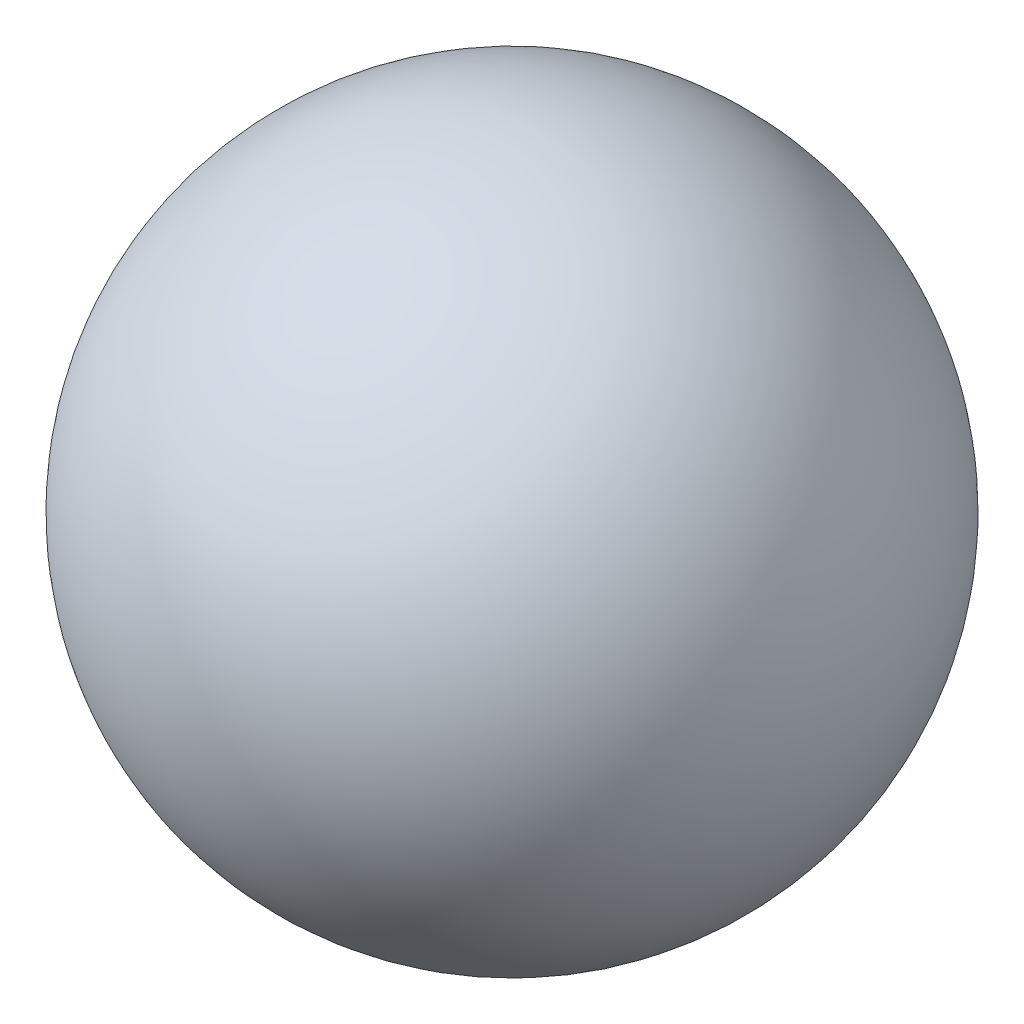
ISO-10303-21;
HEADER;
FILE_DESCRIPTION(('STEP AP214'),'2;1');
FILE_NAME('part.step','',(''),(''),'','','');
FILE_SCHEMA(('AUTOMOTIVE_DESIGN { 1 0 10303 214 1 1 1 1 }'));
ENDSEC;
DATA;
#1=APPLICATION_CONTEXT('core data for automotive mechanical design processes');
#2=APPLICATION_PROTOCOL_DEFINITION('international standard','automotive_design',2000,#1);
#3=PRODUCT_CONTEXT('',#1,'mechanical');
#4=PRODUCT('Part','Part','',(#3));
#5=PRODUCT_RELATED_PRODUCT_CATEGORY('part','',(#4));
#6=PRODUCT_DEFINITION_FORMATION('','',#4);
#7=PRODUCT_DEFINITION_CONTEXT('part definition',#1,'design');
#8=PRODUCT_DEFINITION('design','',#6,#7);
#9=PRODUCT_DEFINITION_SHAPE('','',#8);
#10=(LENGTH_UNIT() NAMED_UNIT(*) SI_UNIT(.MILLI.,.METRE.));
#11=(NAMED_UNIT(*) PLANE_ANGLE_UNIT() SI_UNIT($,.RADIAN.));
#12=(NAMED_UNIT(*) SI_UNIT($,.STERADIAN.) SOLID_ANGLE_UNIT());
#13=UNCERTAINTY_MEASURE_WITH_UNIT(LENGTH_MEASURE(1.E-05),#10,'distance_accuracy_value','');
#14=(GEOMETRIC_REPRESENTATION_CONTEXT(3) GLOBAL_UNCERTAINTY_ASSIGNED_CONTEXT((#13)) GLOBAL_UNIT_ASSIGNED_CONTEXT((#10,
#11,#12)) REPRESENTATION_CONTEXT('',''));
#15=CARTESIAN_POINT('',(0.,0.,0.));
#16=DIRECTION('',(0.,0.,1.));
#17=DIRECTION('',(1.,0.,0.));
#18=AXIS2_PLACEMENT_3D('',#15,#16,#17);
#19=CARTESIAN_POINT('',(-11.4187859278016,-2.,2.77016749223577));
#20=DIRECTION('',(0.,0.,1.));
#21=DIRECTION('',(1.,0.,0.));
#22=AXIS2_PLACEMENT_3D('',#19,#20,#21);
#23=SPHERICAL_SURFACE('',#22,1.05);
#24=CARTESIAN_POINT('',(-11.4187859278016,-2.,3.82016749223577));
#25=VERTEX_POINT('',#24);
#26=VERTEX_LOOP('',#25);
#27=FACE_BOUND('',#26,.T.);
#28=ADVANCED_FACE('F12',(#27),#23,.T.);
#29=CLOSED_SHELL('',(#28));
#30=MANIFOLD_SOLID_BREP('B1',#29);
#31=ADVANCED_BREP_SHAPE_REPRESENTATION('',(#18,#30),#14);
#32=SHAPE_DEFINITION_REPRESENTATION(#9,#31);
ENDSEC;
END-ISO-10303-21;
